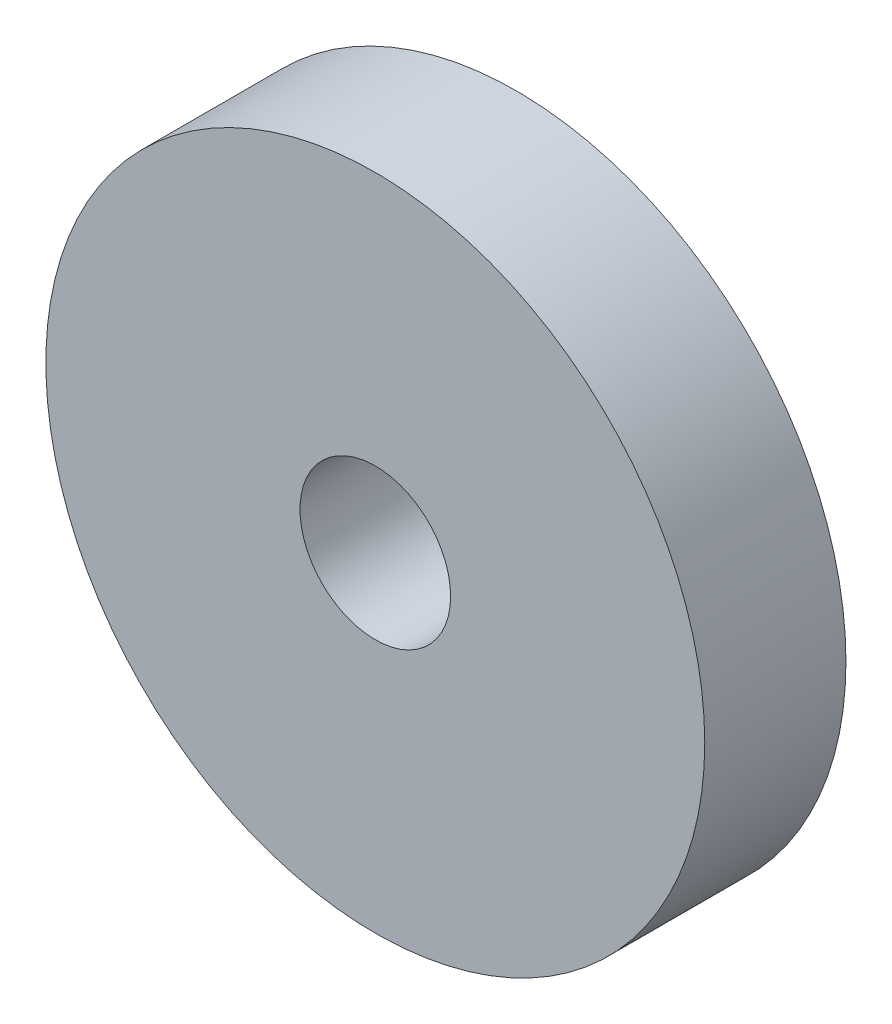
ISO-10303-21;
HEADER;
FILE_DESCRIPTION(('STEP AP214'),'2;1');
FILE_NAME('part.step','',(''),(''),'','','');
FILE_SCHEMA(('AUTOMOTIVE_DESIGN { 1 0 10303 214 1 1 1 1 }'));
ENDSEC;
DATA;
#1=APPLICATION_CONTEXT('core data for automotive mechanical design processes');
#2=APPLICATION_PROTOCOL_DEFINITION('international standard','automotive_design',2000,#1);
#3=PRODUCT_CONTEXT('',#1,'mechanical');
#4=PRODUCT('Part','Part','',(#3));
#5=PRODUCT_RELATED_PRODUCT_CATEGORY('part','',(#4));
#6=PRODUCT_DEFINITION_FORMATION('','',#4);
#7=PRODUCT_DEFINITION_CONTEXT('part definition',#1,'design');
#8=PRODUCT_DEFINITION('design','',#6,#7);
#9=PRODUCT_DEFINITION_SHAPE('','',#8);
#10=(LENGTH_UNIT() NAMED_UNIT(*) SI_UNIT(.MILLI.,.METRE.));
#11=(NAMED_UNIT(*) PLANE_ANGLE_UNIT() SI_UNIT($,.RADIAN.));
#12=(NAMED_UNIT(*) SI_UNIT($,.STERADIAN.) SOLID_ANGLE_UNIT());
#13=UNCERTAINTY_MEASURE_WITH_UNIT(LENGTH_MEASURE(1.E-05),#10,'distance_accuracy_value','');
#14=(GEOMETRIC_REPRESENTATION_CONTEXT(3) GLOBAL_UNCERTAINTY_ASSIGNED_CONTEXT((#13)) GLOBAL_UNIT_ASSIGNED_CONTEXT((#10,
#11,#12)) REPRESENTATION_CONTEXT('',''));
#15=CARTESIAN_POINT('',(0.,0.,0.));
#16=DIRECTION('',(0.,0.,1.));
#17=DIRECTION('',(1.,0.,0.));
#18=AXIS2_PLACEMENT_3D('',#15,#16,#17);
#19=CARTESIAN_POINT('',(0.,0.,3.));
#20=DIRECTION('',(0.,0.,-1.));
#21=DIRECTION('',(-1.,0.,0.));
#22=AXIS2_PLACEMENT_3D('',#19,#20,#21);
#23=CYLINDRICAL_SURFACE('',#22,7.);
#24=CARTESIAN_POINT('',(0.,0.,3.));
#25=DIRECTION('',(0.,0.,1.));
#26=DIRECTION('',(1.,0.,0.));
#27=AXIS2_PLACEMENT_3D('',#24,#25,#26);
#28=CIRCLE('',#27,7.);
#29=CARTESIAN_POINT('',(7.,0.,3.));
#30=VERTEX_POINT('',#29);
#31=EDGE_CURVE('E10',#30,#30,#28,.T.);
#32=ORIENTED_EDGE('',*,*,#31,.F.);
#33=EDGE_LOOP('',(#32));
#34=FACE_BOUND('',#33,.T.);
#35=CARTESIAN_POINT('',(0.,0.,0.));
#36=DIRECTION('',(0.,0.,1.));
#37=DIRECTION('',(1.,0.,0.));
#38=AXIS2_PLACEMENT_3D('',#35,#36,#37);
#39=CIRCLE('',#38,7.);
#40=CARTESIAN_POINT('',(7.,0.,0.));
#41=VERTEX_POINT('',#40);
#42=EDGE_CURVE('E41',#41,#41,#39,.T.);
#43=ORIENTED_EDGE('',*,*,#42,.T.);
#44=EDGE_LOOP('',(#43));
#45=FACE_BOUND('',#44,.T.);
#46=ADVANCED_FACE('F38',(#34,#45),#23,.T.);
#47=CARTESIAN_POINT('',(0.,0.,3.));
#48=DIRECTION('',(0.,0.,1.));
#49=DIRECTION('',(1.,0.,0.));
#50=AXIS2_PLACEMENT_3D('',#47,#48,#49);
#51=PLANE('',#50);
#52=CARTESIAN_POINT('',(0.,0.,3.));
#53=DIRECTION('',(0.,0.,1.));
#54=DIRECTION('',(1.,0.,0.));
#55=AXIS2_PLACEMENT_3D('',#52,#53,#54);
#56=CIRCLE('',#55,1.6);
#57=CARTESIAN_POINT('',(1.6,0.,3.));
#58=VERTEX_POINT('',#57);
#59=EDGE_CURVE('E52',#58,#58,#56,.T.);
#60=ORIENTED_EDGE('',*,*,#59,.F.);
#61=EDGE_LOOP('',(#60));
#62=FACE_BOUND('',#61,.T.);
#63=ORIENTED_EDGE('',*,*,#31,.T.);
#64=EDGE_LOOP('',(#63));
#65=FACE_BOUND('',#64,.T.);
#66=ADVANCED_FACE('F58',(#62,#65),#51,.T.);
#67=CARTESIAN_POINT('',(0.,0.,0.));
#68=DIRECTION('',(0.,0.,1.));
#69=DIRECTION('',(1.,0.,0.));
#70=AXIS2_PLACEMENT_3D('',#67,#68,#69);
#71=PLANE('',#70);
#72=CARTESIAN_POINT('',(0.,0.,0.));
#73=DIRECTION('',(0.,0.,1.));
#74=DIRECTION('',(1.,0.,0.));
#75=AXIS2_PLACEMENT_3D('',#72,#73,#74);
#76=CIRCLE('',#75,1.6);
#77=CARTESIAN_POINT('',(1.6,0.,0.));
#78=VERTEX_POINT('',#77);
#79=EDGE_CURVE('E48',#78,#78,#76,.F.);
#80=ORIENTED_EDGE('',*,*,#79,.F.);
#81=EDGE_LOOP('',(#80));
#82=FACE_BOUND('',#81,.T.);
#83=ORIENTED_EDGE('',*,*,#42,.F.);
#84=EDGE_LOOP('',(#83));
#85=FACE_BOUND('',#84,.T.);
#86=ADVANCED_FACE('F60',(#82,#85),#71,.F.);
#87=CARTESIAN_POINT('',(0.,0.,-4.5254833995939));
#88=DIRECTION('',(0.,0.,1.));
#89=DIRECTION('',(1.,0.,0.));
#90=AXIS2_PLACEMENT_3D('',#87,#88,#89);
#91=CYLINDRICAL_SURFACE('',#90,1.6);
#92=ORIENTED_EDGE('',*,*,#79,.T.);
#93=EDGE_LOOP('',(#92));
#94=FACE_BOUND('',#93,.T.);
#95=ORIENTED_EDGE('',*,*,#59,.T.);
#96=EDGE_LOOP('',(#95));
#97=FACE_BOUND('',#96,.T.);
#98=ADVANCED_FACE('F56',(#94,#97),#91,.F.);
#99=CLOSED_SHELL('',(#46,#66,#86,#98));
#100=MANIFOLD_SOLID_BREP('B2',#99);
#101=ADVANCED_BREP_SHAPE_REPRESENTATION('',(#18,#100),#14);
#102=SHAPE_DEFINITION_REPRESENTATION(#9,#101);
ENDSEC;
END-ISO-10303-21;
